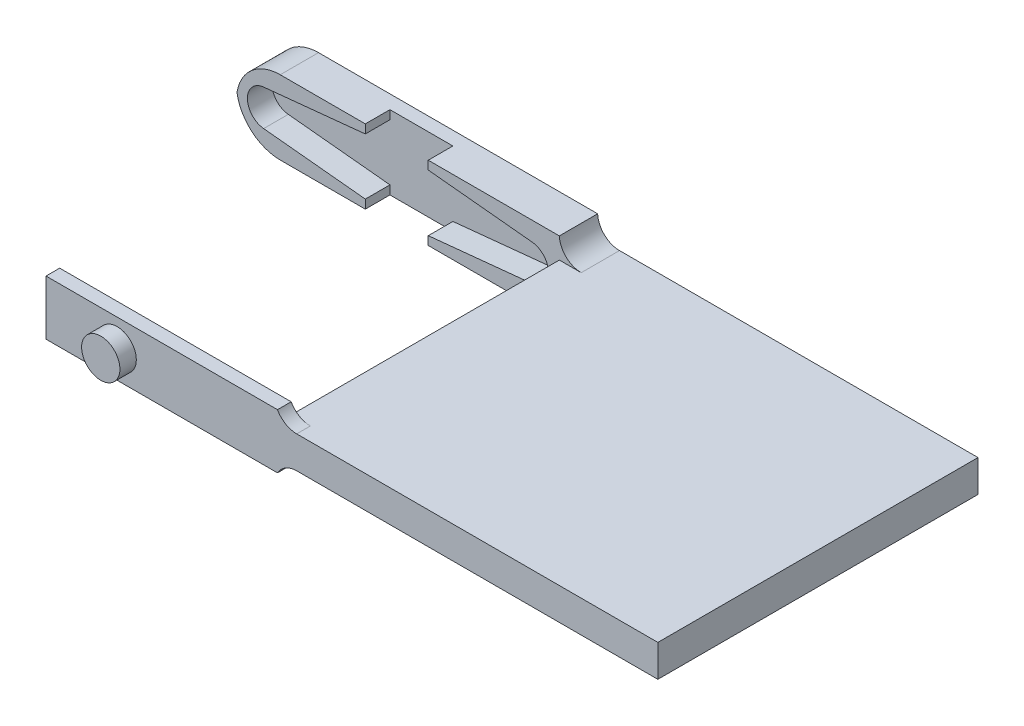
ISO-10303-21;
HEADER;
FILE_DESCRIPTION(('STEP AP214'),'2;1');
FILE_NAME('part.step','',(''),(''),'','','');
FILE_SCHEMA(('AUTOMOTIVE_DESIGN { 1 0 10303 214 1 1 1 1 }'));
ENDSEC;
DATA;
#1=APPLICATION_CONTEXT('core data for automotive mechanical design processes');
#2=APPLICATION_PROTOCOL_DEFINITION('international standard','automotive_design',2000,#1);
#3=PRODUCT_CONTEXT('',#1,'mechanical');
#4=PRODUCT('Part','Part','',(#3));
#5=PRODUCT_RELATED_PRODUCT_CATEGORY('part','',(#4));
#6=PRODUCT_DEFINITION_FORMATION('','',#4);
#7=PRODUCT_DEFINITION_CONTEXT('part definition',#1,'design');
#8=PRODUCT_DEFINITION('design','',#6,#7);
#9=PRODUCT_DEFINITION_SHAPE('','',#8);
#10=(LENGTH_UNIT() NAMED_UNIT(*) SI_UNIT(.MILLI.,.METRE.));
#11=(NAMED_UNIT(*) PLANE_ANGLE_UNIT() SI_UNIT($,.RADIAN.));
#12=(NAMED_UNIT(*) SI_UNIT($,.STERADIAN.) SOLID_ANGLE_UNIT());
#13=UNCERTAINTY_MEASURE_WITH_UNIT(LENGTH_MEASURE(1.E-05),#10,'distance_accuracy_value','');
#14=(GEOMETRIC_REPRESENTATION_CONTEXT(3) GLOBAL_UNCERTAINTY_ASSIGNED_CONTEXT((#13)) GLOBAL_UNIT_ASSIGNED_CONTEXT((#10,
#11,#12)) REPRESENTATION_CONTEXT('',''));
#15=CARTESIAN_POINT('',(0.,0.,0.));
#16=DIRECTION('',(0.,0.,1.));
#17=DIRECTION('',(1.,0.,0.));
#18=AXIS2_PLACEMENT_3D('',#15,#16,#17);
#19=CARTESIAN_POINT('',(0.,0.,29.25));
#20=DIRECTION('',(0.,0.,1.));
#21=DIRECTION('',(1.,0.,0.));
#22=AXIS2_PLACEMENT_3D('',#19,#20,#21);
#23=PLANE('',#22);
#24=DIRECTION('',(1.,0.,0.));
#25=VECTOR('',#24,1.);
#26=CARTESIAN_POINT('',(0.,4.83707186120483,29.25));
#27=LINE('',#26,#25);
#28=CARTESIAN_POINT('',(16.5034017605437,4.83707186120483,29.25));
#29=VERTEX_POINT('',#28);
#30=CARTESIAN_POINT('',(49.5,4.83707186120483,29.25));
#31=VERTEX_POINT('',#30);
#32=EDGE_CURVE('E509',#29,#31,#27,.T.);
#33=ORIENTED_EDGE('',*,*,#32,.F.);
#34=CARTESIAN_POINT('',(16.5034017605437,6.83707186120483,29.25));
#35=DIRECTION('',(0.,0.,1.));
#36=DIRECTION('',(1.,0.,0.));
#37=AXIS2_PLACEMENT_3D('',#34,#35,#36);
#38=CIRCLE('',#37,2.);
#39=CARTESIAN_POINT('',(14.75,5.87500000000001,29.25));
#40=VERTEX_POINT('',#39);
#41=EDGE_CURVE('E445',#29,#40,#38,.F.);
#42=ORIENTED_EDGE('',*,*,#41,.T.);
#43=DIRECTION('',(1.,0.,0.));
#44=VECTOR('',#43,1.);
#45=CARTESIAN_POINT('',(0.,5.87500000000001,29.25));
#46=LINE('',#45,#44);
#47=CARTESIAN_POINT('',(-6.4,5.875,29.25));
#48=VERTEX_POINT('',#47);
#49=EDGE_CURVE('E470',#48,#40,#46,.T.);
#50=ORIENTED_EDGE('',*,*,#49,.F.);
#51=DIRECTION('',(0.,-1.,0.));
#52=VECTOR('',#51,1.);
#53=CARTESIAN_POINT('',(-6.4,0.,29.25));
#54=LINE('',#53,#52);
#55=CARTESIAN_POINT('',(-6.4,0.875000000000003,29.25));
#56=VERTEX_POINT('',#55);
#57=EDGE_CURVE('E473',#48,#56,#54,.T.);
#58=ORIENTED_EDGE('',*,*,#57,.T.);
#59=DIRECTION('',(1.,0.,0.));
#60=VECTOR('',#59,1.);
#61=CARTESIAN_POINT('',(0.,0.875000000000003,29.25));
#62=LINE('',#61,#60);
#63=CARTESIAN_POINT('',(14.75,0.875000000000003,29.25));
#64=VERTEX_POINT('',#63);
#65=EDGE_CURVE('E488',#56,#64,#62,.T.);
#66=ORIENTED_EDGE('',*,*,#65,.T.);
#67=CARTESIAN_POINT('',(16.5034017605437,-0.0870718612048299,29.25));
#68=DIRECTION('',(0.,0.,1.));
#69=DIRECTION('',(1.,0.,0.));
#70=AXIS2_PLACEMENT_3D('',#67,#68,#69);
#71=CIRCLE('',#70,2.);
#72=CARTESIAN_POINT('',(16.5034017605437,1.91292813879517,29.25));
#73=VERTEX_POINT('',#72);
#74=EDGE_CURVE('E449',#64,#73,#71,.F.);
#75=ORIENTED_EDGE('',*,*,#74,.T.);
#76=DIRECTION('',(1.,0.,0.));
#77=VECTOR('',#76,1.);
#78=CARTESIAN_POINT('',(0.,1.91292813879517,29.25));
#79=LINE('',#78,#77);
#80=CARTESIAN_POINT('',(49.5,1.91292813879517,29.25));
#81=VERTEX_POINT('',#80);
#82=EDGE_CURVE('E511',#73,#81,#79,.T.);
#83=ORIENTED_EDGE('',*,*,#82,.T.);
#84=DIRECTION('',(0.,-1.,0.));
#85=VECTOR('',#84,1.);
#86=CARTESIAN_POINT('',(49.5,0.,29.25));
#87=LINE('',#86,#85);
#88=EDGE_CURVE('E513',#31,#81,#87,.T.);
#89=ORIENTED_EDGE('',*,*,#88,.F.);
#90=EDGE_LOOP('',(#33,#42,#50,#58,#66,#75,#83,#89));
#91=FACE_BOUND('',#90,.T.);
#92=CARTESIAN_POINT('',(0.102107464173086,3.37500000000001,29.25));
#93=DIRECTION('',(0.,0.,1.));
#94=DIRECTION('',(1.,0.,0.));
#95=AXIS2_PLACEMENT_3D('',#92,#93,#94);
#96=CIRCLE('',#95,1.7500000000003);
#97=CARTESIAN_POINT('',(1.85210746417339,3.37500000000001,29.25));
#98=VERTEX_POINT('',#97);
#99=EDGE_CURVE('E592',#98,#98,#96,.T.);
#100=ORIENTED_EDGE('',*,*,#99,.F.);
#101=EDGE_LOOP('',(#100));
#102=FACE_BOUND('',#101,.T.);
#103=ADVANCED_FACE('F139',(#91,#102),#23,.T.);
#104=CARTESIAN_POINT('',(0.,0.,3.5));
#105=DIRECTION('',(0.,0.,1.));
#106=DIRECTION('',(1.,0.,0.));
#107=AXIS2_PLACEMENT_3D('',#104,#105,#106);
#108=PLANE('',#107);
#109=DIRECTION('',(0.,-1.,0.));
#110=VECTOR('',#109,1.);
#111=CARTESIAN_POINT('',(-2.97710746417325,0.,3.5));
#112=LINE('',#111,#110);
#113=CARTESIAN_POINT('',(-2.97710746417325,0.79935421821004,3.5));
#114=VERTEX_POINT('',#113);
#115=CARTESIAN_POINT('',(-2.97710746417325,0.,3.5));
#116=VERTEX_POINT('',#115);
#117=EDGE_CURVE('E330',#114,#116,#112,.T.);
#118=ORIENTED_EDGE('',*,*,#117,.F.);
#119=DIRECTION('',(0.994982658758142,-0.10004753255617,0.));
#120=VECTOR('',#119,1.);
#121=CARTESIAN_POINT('',(0.0497727799724651,0.494995245614711,3.5));
#122=LINE('',#121,#120);
#123=CARTESIAN_POINT('',(-12.2650784287177,1.73327861304907,3.5));
#124=VERTEX_POINT('',#123);
#125=EDGE_CURVE('E370',#124,#114,#122,.T.);
#126=ORIENTED_EDGE('',*,*,#125,.F.);
#127=CARTESIAN_POINT('',(-12.1,3.375,3.5));
#128=DIRECTION('',(0.,0.,1.));
#129=DIRECTION('',(1.,0.,0.));
#130=AXIS2_PLACEMENT_3D('',#127,#128,#129);
#131=CIRCLE('',#130,1.65);
#132=CARTESIAN_POINT('',(-12.2650784287177,5.01672138695093,3.5));
#133=VERTEX_POINT('',#132);
#134=EDGE_CURVE('E372',#133,#124,#131,.T.);
#135=ORIENTED_EDGE('',*,*,#134,.F.);
#136=DIRECTION('',(0.994982658758143,0.100047532556171,0.));
#137=VECTOR('',#136,1.);
#138=CARTESIAN_POINT('',(-0.622159749655816,6.18744057018389,3.5));
#139=LINE('',#138,#137);
#140=CARTESIAN_POINT('',(-2.97710746417325,5.95064578178996,3.5));
#141=VERTEX_POINT('',#140);
#142=EDGE_CURVE('E375',#133,#141,#139,.T.);
#143=ORIENTED_EDGE('',*,*,#142,.T.);
#144=DIRECTION('',(0.,-1.,0.));
#145=VECTOR('',#144,1.);
#146=CARTESIAN_POINT('',(-2.97710746417325,6.7500000000001,3.5));
#147=LINE('',#146,#145);
#148=CARTESIAN_POINT('',(-2.97710746417325,6.7500000000001,3.5));
#149=VERTEX_POINT('',#148);
#150=EDGE_CURVE('E605',#149,#141,#147,.T.);
#151=ORIENTED_EDGE('',*,*,#150,.F.);
#152=DIRECTION('',(1.,0.,0.));
#153=VECTOR('',#152,1.);
#154=CARTESIAN_POINT('',(0.,6.75,3.5));
#155=LINE('',#154,#153);
#156=CARTESIAN_POINT('',(-10.75,6.75,3.5));
#157=VERTEX_POINT('',#156);
#158=EDGE_CURVE('E361',#157,#149,#155,.T.);
#159=ORIENTED_EDGE('',*,*,#158,.F.);
#160=CARTESIAN_POINT('',(-10.75,2.75,3.5));
#161=DIRECTION('',(0.,0.,1.));
#162=DIRECTION('',(1.,0.,0.));
#163=AXIS2_PLACEMENT_3D('',#160,#161,#162);
#164=CIRCLE('',#163,4.);
#165=CARTESIAN_POINT('',(-14.7008701573198,3.37499999999999,3.5));
#166=VERTEX_POINT('',#165);
#167=EDGE_CURVE('E148',#157,#166,#164,.T.);
#168=ORIENTED_EDGE('',*,*,#167,.T.);
#169=CARTESIAN_POINT('',(-10.75,4.,3.5));
#170=DIRECTION('',(0.,0.,1.));
#171=DIRECTION('',(1.,0.,0.));
#172=AXIS2_PLACEMENT_3D('',#169,#170,#171);
#173=CIRCLE('',#172,4.);
#174=CARTESIAN_POINT('',(-10.75,0.,3.5));
#175=VERTEX_POINT('',#174);
#176=EDGE_CURVE('E354',#166,#175,#173,.T.);
#177=ORIENTED_EDGE('',*,*,#176,.T.);
#178=DIRECTION('',(1.,0.,0.));
#179=VECTOR('',#178,1.);
#180=CARTESIAN_POINT('',(0.,0.,3.5));
#181=LINE('',#180,#179);
#182=EDGE_CURVE('E347',#175,#116,#181,.T.);
#183=ORIENTED_EDGE('',*,*,#182,.T.);
#184=EDGE_LOOP('',(#118,#126,#135,#143,#151,#159,#168,#177,#183));
#185=FACE_BOUND('',#184,.T.);
#186=ADVANCED_FACE('F352',(#185),#108,.T.);
#187=CARTESIAN_POINT('',(14.75,0.,29.25));
#188=DIRECTION('',(1.,0.,0.));
#189=DIRECTION('',(0.,1.,0.));
#190=AXIS2_PLACEMENT_3D('',#187,#188,#189);
#191=PLANE('',#190);
#192=DIRECTION('',(0.,-1.,0.));
#193=VECTOR('',#192,1.);
#194=CARTESIAN_POINT('',(14.75,0.,28.));
#195=LINE('',#194,#193);
#196=CARTESIAN_POINT('',(14.75,4.83707186120483,28.));
#197=VERTEX_POINT('',#196);
#198=CARTESIAN_POINT('',(14.75,1.91292813879517,28.));
#199=VERTEX_POINT('',#198);
#200=EDGE_CURVE('E484',#197,#199,#195,.T.);
#201=ORIENTED_EDGE('',*,*,#200,.F.);
#202=DIRECTION('',(0.,0.,-1.));
#203=VECTOR('',#202,1.);
#204=CARTESIAN_POINT('',(14.75,4.83707186120483,29.25));
#205=LINE('',#204,#203);
#206=CARTESIAN_POINT('',(14.75,4.83707186120483,3.5));
#207=VERTEX_POINT('',#206);
#208=EDGE_CURVE('E527',#197,#207,#205,.T.);
#209=ORIENTED_EDGE('',*,*,#208,.T.);
#210=DIRECTION('',(0.,-1.,0.));
#211=VECTOR('',#210,1.);
#212=CARTESIAN_POINT('',(14.75,0.,3.5));
#213=LINE('',#212,#211);
#214=CARTESIAN_POINT('',(14.75,1.91292813879517,3.5));
#215=VERTEX_POINT('',#214);
#216=EDGE_CURVE('E384',#207,#215,#213,.T.);
#217=ORIENTED_EDGE('',*,*,#216,.T.);
#218=DIRECTION('',(0.,0.,-1.));
#219=VECTOR('',#218,1.);
#220=CARTESIAN_POINT('',(14.75,1.91292813879517,29.25));
#221=LINE('',#220,#219);
#222=EDGE_CURVE('E524',#199,#215,#221,.T.);
#223=ORIENTED_EDGE('',*,*,#222,.F.);
#224=EDGE_LOOP('',(#201,#209,#217,#223));
#225=FACE_BOUND('',#224,.T.);
#226=ADVANCED_FACE('F647',(#225),#191,.F.);
#227=CARTESIAN_POINT('',(0.622159749655816,6.18744057018389,3.5));
#228=DIRECTION('',(-0.100047532556171,-0.994982658758142,0.));
#229=DIRECTION('',(0.994982658758142,-0.100047532556171,0.));
#230=AXIS2_PLACEMENT_3D('',#227,#228,#229);
#231=PLANE('',#230);
#232=DIRECTION('',(0.,0.,1.));
#233=VECTOR('',#232,1.);
#234=CARTESIAN_POINT('',(2.77289253582673,5.97118000870574,3.5));
#235=LINE('',#234,#233);
#236=CARTESIAN_POINT('',(2.77289253582673,5.97118000870574,1.24999999999995));
#237=VERTEX_POINT('',#236);
#238=CARTESIAN_POINT('',(2.77289253582673,5.97118000870574,3.5));
#239=VERTEX_POINT('',#238);
#240=EDGE_CURVE('E163',#237,#239,#235,.T.);
#241=ORIENTED_EDGE('',*,*,#240,.F.);
#242=DIRECTION('',(-0.994982658758143,0.100047532556171,0.));
#243=VECTOR('',#242,1.);
#244=CARTESIAN_POINT('',(0.622159749655816,6.18744057018389,1.25));
#245=LINE('',#244,#243);
#246=CARTESIAN_POINT('',(12.2650784287177,5.01672138695093,1.25));
#247=VERTEX_POINT('',#246);
#248=EDGE_CURVE('E533',#247,#237,#245,.T.);
#249=ORIENTED_EDGE('',*,*,#248,.F.);
#250=DIRECTION('',(0.,0.,-1.));
#251=VECTOR('',#250,1.);
#252=CARTESIAN_POINT('',(12.2650784287177,5.01672138695093,3.5));
#253=LINE('',#252,#251);
#254=CARTESIAN_POINT('',(12.2650784287177,5.01672138695093,3.5));
#255=VERTEX_POINT('',#254);
#256=EDGE_CURVE('E395',#255,#247,#253,.T.);
#257=ORIENTED_EDGE('',*,*,#256,.F.);
#258=DIRECTION('',(-0.994982658758143,0.100047532556171,0.));
#259=VECTOR('',#258,1.);
#260=CARTESIAN_POINT('',(0.622159749655816,6.18744057018389,3.5));
#261=LINE('',#260,#259);
#262=EDGE_CURVE('E355',#255,#239,#261,.T.);
#263=ORIENTED_EDGE('',*,*,#262,.T.);
#264=EDGE_LOOP('',(#241,#249,#257,#263));
#265=FACE_BOUND('',#264,.T.);
#266=ADVANCED_FACE('F662',(#265),#231,.T.);
#267=CARTESIAN_POINT('',(12.1,3.375,3.5));
#268=DIRECTION('',(0.,0.,-1.));
#269=DIRECTION('',(-1.,0.,0.));
#270=AXIS2_PLACEMENT_3D('',#267,#268,#269);
#271=CYLINDRICAL_SURFACE('',#270,1.64999999999999);
#272=ORIENTED_EDGE('',*,*,#256,.T.);
#273=CARTESIAN_POINT('',(12.1,3.375,1.25));
#274=DIRECTION('',(0.,0.,1.));
#275=DIRECTION('',(1.,0.,0.));
#276=AXIS2_PLACEMENT_3D('',#273,#274,#275);
#277=CIRCLE('',#276,1.64999999999999);
#278=CARTESIAN_POINT('',(12.2650784287177,1.73327861304907,1.25));
#279=VERTEX_POINT('',#278);
#280=EDGE_CURVE('E530',#247,#279,#277,.F.);
#281=ORIENTED_EDGE('',*,*,#280,.T.);
#282=DIRECTION('',(0.,0.,-1.));
#283=VECTOR('',#282,1.);
#284=CARTESIAN_POINT('',(12.2650784287177,1.73327861304907,3.5));
#285=LINE('',#284,#283);
#286=CARTESIAN_POINT('',(12.2650784287177,1.73327861304907,3.5));
#287=VERTEX_POINT('',#286);
#288=EDGE_CURVE('E392',#287,#279,#285,.T.);
#289=ORIENTED_EDGE('',*,*,#288,.F.);
#290=CARTESIAN_POINT('',(12.1,3.375,3.5));
#291=DIRECTION('',(0.,0.,1.));
#292=DIRECTION('',(1.,0.,0.));
#293=AXIS2_PLACEMENT_3D('',#290,#291,#292);
#294=CIRCLE('',#293,1.64999999999999);
#295=EDGE_CURVE('E359',#255,#287,#294,.F.);
#296=ORIENTED_EDGE('',*,*,#295,.F.);
#297=EDGE_LOOP('',(#272,#281,#289,#296));
#298=FACE_BOUND('',#297,.T.);
#299=ADVANCED_FACE('F638',(#298),#271,.F.);
#300=CARTESIAN_POINT('',(-0.0497727799724653,0.49499524561471,3.5));
#301=DIRECTION('',(0.100047532556171,-0.994982658758142,0.));
#302=DIRECTION('',(0.994982658758143,0.100047532556171,0.));
#303=AXIS2_PLACEMENT_3D('',#300,#301,#302);
#304=PLANE('',#303);
#305=DIRECTION('',(-0.994982658758142,-0.100047532556171,0.));
#306=VECTOR('',#305,1.);
#307=CARTESIAN_POINT('',(-0.0497727799724653,0.49499524561471,1.25));
#308=LINE('',#307,#306);
#309=CARTESIAN_POINT('',(2.77289253582673,0.778819991294262,1.24999999999995));
#310=VERTEX_POINT('',#309);
#311=EDGE_CURVE('E382',#279,#310,#308,.T.);
#312=ORIENTED_EDGE('',*,*,#311,.T.);
#313=DIRECTION('',(0.,0.,1.));
#314=VECTOR('',#313,1.);
#315=CARTESIAN_POINT('',(2.77289253582673,0.778819991294262,3.5));
#316=LINE('',#315,#314);
#317=CARTESIAN_POINT('',(2.77289253582673,0.778819991294262,3.5));
#318=VERTEX_POINT('',#317);
#319=EDGE_CURVE('E599',#310,#318,#316,.T.);
#320=ORIENTED_EDGE('',*,*,#319,.T.);
#321=DIRECTION('',(-0.994982658758142,-0.100047532556171,0.));
#322=VECTOR('',#321,1.);
#323=CARTESIAN_POINT('',(-0.0497727799724653,0.49499524561471,3.5));
#324=LINE('',#323,#322);
#325=EDGE_CURVE('E367',#287,#318,#324,.T.);
#326=ORIENTED_EDGE('',*,*,#325,.F.);
#327=ORIENTED_EDGE('',*,*,#288,.T.);
#328=EDGE_LOOP('',(#312,#320,#326,#327));
#329=FACE_BOUND('',#328,.T.);
#330=ADVANCED_FACE('F631',(#329),#304,.F.);
#331=CARTESIAN_POINT('',(0.0497727799724651,0.494995245614711,3.5));
#332=DIRECTION('',(0.10004753255617,0.994982658758143,0.));
#333=DIRECTION('',(-0.994982658758143,0.10004753255617,0.));
#334=AXIS2_PLACEMENT_3D('',#331,#332,#333);
#335=PLANE('',#334);
#336=DIRECTION('',(0.,0.,1.));
#337=VECTOR('',#336,1.);
#338=CARTESIAN_POINT('',(-2.97710746417325,0.79935421821004,3.5));
#339=LINE('',#338,#337);
#340=CARTESIAN_POINT('',(-2.97710746417325,0.79935421821004,1.24999999999995));
#341=VERTEX_POINT('',#340);
#342=EDGE_CURVE('E336',#341,#114,#339,.T.);
#343=ORIENTED_EDGE('',*,*,#342,.F.);
#344=DIRECTION('',(0.994982658758142,-0.10004753255617,0.));
#345=VECTOR('',#344,1.);
#346=CARTESIAN_POINT('',(0.0497727799724651,0.494995245614711,1.25));
#347=LINE('',#346,#345);
#348=CARTESIAN_POINT('',(-12.2650784287177,1.73327861304907,1.25));
#349=VERTEX_POINT('',#348);
#350=EDGE_CURVE('E540',#349,#341,#347,.T.);
#351=ORIENTED_EDGE('',*,*,#350,.F.);
#352=DIRECTION('',(0.,0.,-1.));
#353=VECTOR('',#352,1.);
#354=CARTESIAN_POINT('',(-12.2650784287177,1.73327861304907,3.5));
#355=LINE('',#354,#353);
#356=EDGE_CURVE('E388',#124,#349,#355,.T.);
#357=ORIENTED_EDGE('',*,*,#356,.F.);
#358=ORIENTED_EDGE('',*,*,#125,.T.);
#359=EDGE_LOOP('',(#343,#351,#357,#358));
#360=FACE_BOUND('',#359,.T.);
#361=ADVANCED_FACE('F629',(#360),#335,.T.);
#362=CARTESIAN_POINT('',(-12.1,3.375,3.5));
#363=DIRECTION('',(0.,0.,-1.));
#364=DIRECTION('',(-1.,0.,0.));
#365=AXIS2_PLACEMENT_3D('',#362,#363,#364);
#366=CYLINDRICAL_SURFACE('',#365,1.65);
#367=CARTESIAN_POINT('',(-12.1,3.375,1.25));
#368=DIRECTION('',(0.,0.,1.));
#369=DIRECTION('',(1.,0.,0.));
#370=AXIS2_PLACEMENT_3D('',#367,#368,#369);
#371=CIRCLE('',#370,1.65);
#372=CARTESIAN_POINT('',(-12.2650784287177,5.01672138695093,1.25));
#373=VERTEX_POINT('',#372);
#374=EDGE_CURVE('E538',#373,#349,#371,.T.);
#375=ORIENTED_EDGE('',*,*,#374,.F.);
#376=DIRECTION('',(0.,0.,-1.));
#377=VECTOR('',#376,1.);
#378=CARTESIAN_POINT('',(-12.2650784287177,5.01672138695093,3.5));
#379=LINE('',#378,#377);
#380=EDGE_CURVE('E385',#133,#373,#379,.T.);
#381=ORIENTED_EDGE('',*,*,#380,.F.);
#382=ORIENTED_EDGE('',*,*,#134,.T.);
#383=ORIENTED_EDGE('',*,*,#356,.T.);
#384=EDGE_LOOP('',(#375,#381,#382,#383));
#385=FACE_BOUND('',#384,.T.);
#386=ADVANCED_FACE('F624',(#385),#366,.F.);
#387=CARTESIAN_POINT('',(0.,6.75,3.5));
#388=DIRECTION('',(0.,1.,0.));
#389=DIRECTION('',(0.,0.,1.));
#390=AXIS2_PLACEMENT_3D('',#387,#388,#389);
#391=PLANE('',#390);
#392=DIRECTION('',(0.,0.,1.));
#393=VECTOR('',#392,1.);
#394=CARTESIAN_POINT('',(-2.97710746417325,6.7500000000001,-4.60902082262902));
#395=LINE('',#394,#393);
#396=CARTESIAN_POINT('',(-2.97710746417325,6.7500000000001,1.24999999999995));
#397=VERTEX_POINT('',#396);
#398=EDGE_CURVE('E480',#397,#149,#395,.T.);
#399=ORIENTED_EDGE('',*,*,#398,.F.);
#400=DIRECTION('',(-1.,0.,0.));
#401=VECTOR('',#400,1.);
#402=CARTESIAN_POINT('',(-2.97710746417325,6.7500000000001,1.24999999999995));
#403=LINE('',#402,#401);
#404=CARTESIAN_POINT('',(2.77289253582673,6.7500000000001,1.24999999999995));
#405=VERTEX_POINT('',#404);
#406=EDGE_CURVE('E613',#405,#397,#403,.T.);
#407=ORIENTED_EDGE('',*,*,#406,.F.);
#408=DIRECTION('',(0.,0.,1.));
#409=VECTOR('',#408,1.);
#410=CARTESIAN_POINT('',(2.77289253582673,6.7500000000001,-4.60902082262902));
#411=LINE('',#410,#409);
#412=CARTESIAN_POINT('',(2.77289253582673,6.7500000000001,3.5));
#413=VERTEX_POINT('',#412);
#414=EDGE_CURVE('E616',#405,#413,#411,.T.);
#415=ORIENTED_EDGE('',*,*,#414,.T.);
#416=CARTESIAN_POINT('',(14.75,6.75,3.5));
#417=VERTEX_POINT('',#416);
#418=EDGE_CURVE('E545',#413,#417,#155,.T.);
#419=ORIENTED_EDGE('',*,*,#418,.T.);
#420=DIRECTION('',(0.,0.,-1.));
#421=VECTOR('',#420,1.);
#422=CARTESIAN_POINT('',(14.75,6.75,3.5));
#423=LINE('',#422,#421);
#424=CARTESIAN_POINT('',(14.75,6.75,0.));
#425=VERTEX_POINT('',#424);
#426=EDGE_CURVE('E389',#417,#425,#423,.T.);
#427=ORIENTED_EDGE('',*,*,#426,.T.);
#428=DIRECTION('',(1.,0.,0.));
#429=VECTOR('',#428,1.);
#430=CARTESIAN_POINT('',(0.,6.75,0.));
#431=LINE('',#430,#429);
#432=CARTESIAN_POINT('',(-10.75,6.75,0.));
#433=VERTEX_POINT('',#432);
#434=EDGE_CURVE('E379',#433,#425,#431,.T.);
#435=ORIENTED_EDGE('',*,*,#434,.F.);
#436=DIRECTION('',(0.,0.,-1.));
#437=VECTOR('',#436,1.);
#438=CARTESIAN_POINT('',(-10.75,6.75,3.5));
#439=LINE('',#438,#437);
#440=EDGE_CURVE('E455',#433,#157,#439,.F.);
#441=ORIENTED_EDGE('',*,*,#440,.T.);
#442=ORIENTED_EDGE('',*,*,#158,.T.);
#443=EDGE_LOOP('',(#399,#407,#415,#419,#427,#435,#441,#442));
#444=FACE_BOUND('',#443,.T.);
#445=ADVANCED_FACE('F553',(#444),#391,.T.);
#446=CARTESIAN_POINT('',(0.,0.,3.5));
#447=DIRECTION('',(0.,1.,0.));
#448=DIRECTION('',(0.,0.,1.));
#449=AXIS2_PLACEMENT_3D('',#446,#447,#448);
#450=PLANE('',#449);
#451=DIRECTION('',(1.,0.,0.));
#452=VECTOR('',#451,1.);
#453=CARTESIAN_POINT('',(-2.97710746417325,0.,1.24999999999995));
#454=LINE('',#453,#452);
#455=CARTESIAN_POINT('',(-2.97710746417325,0.,1.24999999999995));
#456=VERTEX_POINT('',#455);
#457=CARTESIAN_POINT('',(2.77289253582673,0.,1.24999999999995));
#458=VERTEX_POINT('',#457);
#459=EDGE_CURVE('E350',#456,#458,#454,.T.);
#460=ORIENTED_EDGE('',*,*,#459,.F.);
#461=DIRECTION('',(0.,0.,1.));
#462=VECTOR('',#461,1.);
#463=CARTESIAN_POINT('',(-2.97710746417325,0.,-4.60902082262902));
#464=LINE('',#463,#462);
#465=EDGE_CURVE('E333',#456,#116,#464,.T.);
#466=ORIENTED_EDGE('',*,*,#465,.T.);
#467=ORIENTED_EDGE('',*,*,#182,.F.);
#468=DIRECTION('',(0.,0.,-1.));
#469=VECTOR('',#468,1.);
#470=CARTESIAN_POINT('',(-10.75,0.,0.));
#471=LINE('',#470,#469);
#472=CARTESIAN_POINT('',(-10.75,0.,0.));
#473=VERTEX_POINT('',#472);
#474=EDGE_CURVE('E12',#175,#473,#471,.T.);
#475=ORIENTED_EDGE('',*,*,#474,.T.);
#476=DIRECTION('',(1.,0.,0.));
#477=VECTOR('',#476,1.);
#478=CARTESIAN_POINT('',(0.,0.,0.));
#479=LINE('',#478,#477);
#480=CARTESIAN_POINT('',(14.75,0.,0.));
#481=VERTEX_POINT('',#480);
#482=EDGE_CURVE('E381',#473,#481,#479,.T.);
#483=ORIENTED_EDGE('',*,*,#482,.T.);
#484=DIRECTION('',(0.,0.,-1.));
#485=VECTOR('',#484,1.);
#486=CARTESIAN_POINT('',(14.75,0.,3.5));
#487=LINE('',#486,#485);
#488=CARTESIAN_POINT('',(14.75,0.,3.5));
#489=VERTEX_POINT('',#488);
#490=EDGE_CURVE('E378',#489,#481,#487,.T.);
#491=ORIENTED_EDGE('',*,*,#490,.F.);
#492=CARTESIAN_POINT('',(2.77289253582673,0.,3.5));
#493=VERTEX_POINT('',#492);
#494=EDGE_CURVE('E356',#493,#489,#181,.T.);
#495=ORIENTED_EDGE('',*,*,#494,.F.);
#496=DIRECTION('',(0.,0.,1.));
#497=VECTOR('',#496,1.);
#498=CARTESIAN_POINT('',(2.77289253582673,0.,-4.60902082262902));
#499=LINE('',#498,#497);
#500=EDGE_CURVE('E155',#458,#493,#499,.T.);
#501=ORIENTED_EDGE('',*,*,#500,.F.);
#502=EDGE_LOOP('',(#460,#466,#467,#475,#483,#491,#495,#501));
#503=FACE_BOUND('',#502,.T.);
#504=ADVANCED_FACE('F346',(#503),#450,.F.);
#505=CARTESIAN_POINT('',(-0.622159749655816,6.18744057018389,3.5));
#506=DIRECTION('',(-0.100047532556171,0.994982658758142,0.));
#507=DIRECTION('',(-0.994982658758142,-0.100047532556171,0.));
#508=AXIS2_PLACEMENT_3D('',#505,#506,#507);
#509=PLANE('',#508);
#510=DIRECTION('',(0.994982658758143,0.100047532556171,0.));
#511=VECTOR('',#510,1.);
#512=CARTESIAN_POINT('',(-0.622159749655816,6.18744057018389,1.25));
#513=LINE('',#512,#511);
#514=CARTESIAN_POINT('',(-2.97710746417325,5.95064578178996,1.24999999999995));
#515=VERTEX_POINT('',#514);
#516=EDGE_CURVE('E536',#373,#515,#513,.T.);
#517=ORIENTED_EDGE('',*,*,#516,.T.);
#518=DIRECTION('',(0.,0.,1.));
#519=VECTOR('',#518,1.);
#520=CARTESIAN_POINT('',(-2.97710746417325,5.95064578178996,3.5));
#521=LINE('',#520,#519);
#522=EDGE_CURVE('E471',#515,#141,#521,.T.);
#523=ORIENTED_EDGE('',*,*,#522,.T.);
#524=ORIENTED_EDGE('',*,*,#142,.F.);
#525=ORIENTED_EDGE('',*,*,#380,.T.);
#526=EDGE_LOOP('',(#517,#523,#524,#525));
#527=FACE_BOUND('',#526,.T.);
#528=ADVANCED_FACE('F621',(#527),#509,.F.);
#529=DIRECTION('',(0.,1.,0.));
#530=VECTOR('',#529,1.);
#531=CARTESIAN_POINT('',(2.77289253582673,0.,3.5));
#532=LINE('',#531,#530);
#533=EDGE_CURVE('E342',#493,#318,#532,.T.);
#534=ORIENTED_EDGE('',*,*,#533,.F.);
#535=ORIENTED_EDGE('',*,*,#494,.T.);
#536=CARTESIAN_POINT('',(16.7481037237807,-0.0870718612048299,3.5));
#537=DIRECTION('',(0.,0.,1.));
#538=DIRECTION('',(1.,0.,0.));
#539=AXIS2_PLACEMENT_3D('',#536,#537,#538);
#540=CIRCLE('',#539,2.);
#541=CARTESIAN_POINT('',(16.7481037237807,1.91292813879517,3.5));
#542=VERTEX_POINT('',#541);
#543=EDGE_CURVE('E441',#489,#542,#540,.F.);
#544=ORIENTED_EDGE('',*,*,#543,.T.);
#545=DIRECTION('',(1.,0.,0.));
#546=VECTOR('',#545,1.);
#547=CARTESIAN_POINT('',(0.,1.91292813879517,3.5));
#548=LINE('',#547,#546);
#549=EDGE_CURVE('E427',#215,#542,#548,.T.);
#550=ORIENTED_EDGE('',*,*,#549,.F.);
#551=ORIENTED_EDGE('',*,*,#216,.F.);
#552=DIRECTION('',(-1.,0.,0.));
#553=VECTOR('',#552,1.);
#554=CARTESIAN_POINT('',(0.,4.83707186120483,3.5));
#555=LINE('',#554,#553);
#556=CARTESIAN_POINT('',(16.7481037237807,4.83707186120483,3.5));
#557=VERTEX_POINT('',#556);
#558=EDGE_CURVE('E415',#557,#207,#555,.T.);
#559=ORIENTED_EDGE('',*,*,#558,.F.);
#560=CARTESIAN_POINT('',(16.7481037237807,6.83707186120483,3.5));
#561=DIRECTION('',(0.,0.,1.));
#562=DIRECTION('',(1.,0.,0.));
#563=AXIS2_PLACEMENT_3D('',#560,#561,#562);
#564=CIRCLE('',#563,2.);
#565=EDGE_CURVE('E435',#557,#417,#564,.F.);
#566=ORIENTED_EDGE('',*,*,#565,.T.);
#567=ORIENTED_EDGE('',*,*,#418,.F.);
#568=DIRECTION('',(0.,1.,0.));
#569=VECTOR('',#568,1.);
#570=CARTESIAN_POINT('',(2.77289253582673,6.7500000000001,3.5));
#571=LINE('',#570,#569);
#572=EDGE_CURVE('E606',#239,#413,#571,.T.);
#573=ORIENTED_EDGE('',*,*,#572,.F.);
#574=ORIENTED_EDGE('',*,*,#262,.F.);
#575=ORIENTED_EDGE('',*,*,#295,.T.);
#576=ORIENTED_EDGE('',*,*,#325,.T.);
#577=EDGE_LOOP('',(#534,#535,#544,#550,#551,#559,#566,#567,#573,#574,#575,#576));
#578=FACE_BOUND('',#577,.T.);
#579=ADVANCED_FACE('F587',(#578),#108,.T.);
#580=CARTESIAN_POINT('',(0.,0.,0.));
#581=DIRECTION('',(0.,0.,1.));
#582=DIRECTION('',(1.,0.,0.));
#583=AXIS2_PLACEMENT_3D('',#580,#581,#582);
#584=PLANE('',#583);
#585=CARTESIAN_POINT('',(-10.75,4.,0.));
#586=DIRECTION('',(0.,0.,1.));
#587=DIRECTION('',(1.,0.,0.));
#588=AXIS2_PLACEMENT_3D('',#585,#586,#587);
#589=CIRCLE('',#588,4.);
#590=CARTESIAN_POINT('',(-14.7008701573198,3.37499999999999,0.));
#591=VERTEX_POINT('',#590);
#592=EDGE_CURVE('E451',#473,#591,#589,.F.);
#593=ORIENTED_EDGE('',*,*,#592,.T.);
#594=CARTESIAN_POINT('',(-10.75,2.75,0.));
#595=DIRECTION('',(0.,0.,1.));
#596=DIRECTION('',(1.,0.,0.));
#597=AXIS2_PLACEMENT_3D('',#594,#595,#596);
#598=CIRCLE('',#597,4.);
#599=EDGE_CURVE('E453',#591,#433,#598,.F.);
#600=ORIENTED_EDGE('',*,*,#599,.T.);
#601=ORIENTED_EDGE('',*,*,#434,.T.);
#602=CARTESIAN_POINT('',(16.7481037237807,6.83707186120483,0.));
#603=DIRECTION('',(0.,0.,1.));
#604=DIRECTION('',(1.,0.,0.));
#605=AXIS2_PLACEMENT_3D('',#602,#603,#604);
#606=CIRCLE('',#605,2.);
#607=CARTESIAN_POINT('',(16.7481037237807,4.83707186120483,0.));
#608=VERTEX_POINT('',#607);
#609=EDGE_CURVE('E433',#425,#608,#606,.T.);
#610=ORIENTED_EDGE('',*,*,#609,.T.);
#611=DIRECTION('',(1.,0.,0.));
#612=VECTOR('',#611,1.);
#613=CARTESIAN_POINT('',(0.,4.83707186120483,0.));
#614=LINE('',#613,#612);
#615=CARTESIAN_POINT('',(49.5,4.83707186120483,0.));
#616=VERTEX_POINT('',#615);
#617=EDGE_CURVE('E407',#608,#616,#614,.T.);
#618=ORIENTED_EDGE('',*,*,#617,.T.);
#619=DIRECTION('',(0.,-1.,0.));
#620=VECTOR('',#619,1.);
#621=CARTESIAN_POINT('',(49.5,0.,0.));
#622=LINE('',#621,#620);
#623=CARTESIAN_POINT('',(49.5,1.91292813879517,0.));
#624=VERTEX_POINT('',#623);
#625=EDGE_CURVE('E422',#616,#624,#622,.T.);
#626=ORIENTED_EDGE('',*,*,#625,.T.);
#627=DIRECTION('',(1.,0.,0.));
#628=VECTOR('',#627,1.);
#629=CARTESIAN_POINT('',(0.,1.91292813879517,0.));
#630=LINE('',#629,#628);
#631=CARTESIAN_POINT('',(16.7481037237807,1.91292813879517,0.));
#632=VERTEX_POINT('',#631);
#633=EDGE_CURVE('E409',#632,#624,#630,.T.);
#634=ORIENTED_EDGE('',*,*,#633,.F.);
#635=CARTESIAN_POINT('',(16.7481037237807,-0.0870718612048299,0.));
#636=DIRECTION('',(0.,0.,1.));
#637=DIRECTION('',(1.,0.,0.));
#638=AXIS2_PLACEMENT_3D('',#635,#636,#637);
#639=CIRCLE('',#638,2.);
#640=EDGE_CURVE('E438',#632,#481,#639,.T.);
#641=ORIENTED_EDGE('',*,*,#640,.T.);
#642=ORIENTED_EDGE('',*,*,#482,.F.);
#643=EDGE_LOOP('',(#593,#600,#601,#610,#618,#626,#634,#641,#642));
#644=FACE_BOUND('',#643,.T.);
#645=ADVANCED_FACE('F559',(#644),#584,.F.);
#646=CARTESIAN_POINT('',(0.,0.,1.25));
#647=DIRECTION('',(0.,0.,1.));
#648=DIRECTION('',(1.,0.,0.));
#649=AXIS2_PLACEMENT_3D('',#646,#647,#648);
#650=PLANE('',#649);
#651=ORIENTED_EDGE('',*,*,#350,.T.);
#652=DIRECTION('',(0.,-1.,0.));
#653=VECTOR('',#652,1.);
#654=CARTESIAN_POINT('',(-2.97710746417325,0.,1.24999999999995));
#655=LINE('',#654,#653);
#656=EDGE_CURVE('E341',#341,#456,#655,.T.);
#657=ORIENTED_EDGE('',*,*,#656,.T.);
#658=ORIENTED_EDGE('',*,*,#459,.T.);
#659=DIRECTION('',(0.,1.,0.));
#660=VECTOR('',#659,1.);
#661=CARTESIAN_POINT('',(2.77289253582673,0.,1.24999999999995));
#662=LINE('',#661,#660);
#663=EDGE_CURVE('E596',#458,#310,#662,.T.);
#664=ORIENTED_EDGE('',*,*,#663,.T.);
#665=ORIENTED_EDGE('',*,*,#311,.F.);
#666=ORIENTED_EDGE('',*,*,#280,.F.);
#667=ORIENTED_EDGE('',*,*,#248,.T.);
#668=DIRECTION('',(0.,1.,0.));
#669=VECTOR('',#668,1.);
#670=CARTESIAN_POINT('',(2.77289253582673,6.7500000000001,1.24999999999995));
#671=LINE('',#670,#669);
#672=EDGE_CURVE('E612',#237,#405,#671,.T.);
#673=ORIENTED_EDGE('',*,*,#672,.T.);
#674=ORIENTED_EDGE('',*,*,#406,.T.);
#675=DIRECTION('',(0.,-1.,0.));
#676=VECTOR('',#675,1.);
#677=CARTESIAN_POINT('',(-2.97710746417325,6.7500000000001,1.24999999999995));
#678=LINE('',#677,#676);
#679=EDGE_CURVE('E608',#397,#515,#678,.T.);
#680=ORIENTED_EDGE('',*,*,#679,.T.);
#681=ORIENTED_EDGE('',*,*,#516,.F.);
#682=ORIENTED_EDGE('',*,*,#374,.T.);
#683=EDGE_LOOP('',(#651,#657,#658,#664,#665,#666,#667,#673,#674,#680,#681,#682));
#684=FACE_BOUND('',#683,.T.);
#685=ADVANCED_FACE('F627',(#684),#650,.T.);
#686=CARTESIAN_POINT('',(0.,4.83707186120483,29.25));
#687=DIRECTION('',(0.,1.,0.));
#688=DIRECTION('',(0.,0.,1.));
#689=AXIS2_PLACEMENT_3D('',#686,#687,#688);
#690=PLANE('',#689);
#691=ORIENTED_EDGE('',*,*,#617,.F.);
#692=DIRECTION('',(0.,0.,-1.));
#693=VECTOR('',#692,1.);
#694=CARTESIAN_POINT('',(16.7481037237807,4.83707186120483,3.5));
#695=LINE('',#694,#693);
#696=EDGE_CURVE('E417',#608,#557,#695,.F.);
#697=ORIENTED_EDGE('',*,*,#696,.T.);
#698=ORIENTED_EDGE('',*,*,#558,.T.);
#699=ORIENTED_EDGE('',*,*,#208,.F.);
#700=DIRECTION('',(1.,0.,0.));
#701=VECTOR('',#700,1.);
#702=CARTESIAN_POINT('',(0.,4.83707186120483,28.));
#703=LINE('',#702,#701);
#704=CARTESIAN_POINT('',(16.5034017605437,4.83707186120483,28.));
#705=VERTEX_POINT('',#704);
#706=EDGE_CURVE('E412',#197,#705,#703,.T.);
#707=ORIENTED_EDGE('',*,*,#706,.T.);
#708=DIRECTION('',(0.,0.,-1.));
#709=VECTOR('',#708,1.);
#710=CARTESIAN_POINT('',(16.5034017605437,4.83707186120483,29.25));
#711=LINE('',#710,#709);
#712=EDGE_CURVE('E398',#705,#29,#711,.F.);
#713=ORIENTED_EDGE('',*,*,#712,.T.);
#714=ORIENTED_EDGE('',*,*,#32,.T.);
#715=DIRECTION('',(0.,0.,-1.));
#716=VECTOR('',#715,1.);
#717=CARTESIAN_POINT('',(49.5,4.83707186120483,29.25));
#718=LINE('',#717,#716);
#719=EDGE_CURVE('E516',#31,#616,#718,.T.);
#720=ORIENTED_EDGE('',*,*,#719,.T.);
#721=EDGE_LOOP('',(#691,#697,#698,#699,#707,#713,#714,#720));
#722=FACE_BOUND('',#721,.T.);
#723=ADVANCED_FACE('F566',(#722),#690,.T.);
#724=CARTESIAN_POINT('',(0.,1.91292813879517,29.25));
#725=DIRECTION('',(0.,1.,0.));
#726=DIRECTION('',(0.,0.,1.));
#727=AXIS2_PLACEMENT_3D('',#724,#725,#726);
#728=PLANE('',#727);
#729=ORIENTED_EDGE('',*,*,#549,.T.);
#730=DIRECTION('',(0.,0.,1.));
#731=VECTOR('',#730,1.);
#732=CARTESIAN_POINT('',(16.7481037237807,1.91292813879517,29.25));
#733=LINE('',#732,#731);
#734=EDGE_CURVE('E430',#542,#632,#733,.F.);
#735=ORIENTED_EDGE('',*,*,#734,.T.);
#736=ORIENTED_EDGE('',*,*,#633,.T.);
#737=DIRECTION('',(0.,0.,-1.));
#738=VECTOR('',#737,1.);
#739=CARTESIAN_POINT('',(49.5,1.91292813879517,29.25));
#740=LINE('',#739,#738);
#741=EDGE_CURVE('E521',#81,#624,#740,.T.);
#742=ORIENTED_EDGE('',*,*,#741,.F.);
#743=ORIENTED_EDGE('',*,*,#82,.F.);
#744=DIRECTION('',(0.,0.,1.));
#745=VECTOR('',#744,1.);
#746=CARTESIAN_POINT('',(16.5034017605437,1.91292813879517,29.25));
#747=LINE('',#746,#745);
#748=CARTESIAN_POINT('',(16.5034017605437,1.91292813879517,28.));
#749=VERTEX_POINT('',#748);
#750=EDGE_CURVE('E424',#73,#749,#747,.F.);
#751=ORIENTED_EDGE('',*,*,#750,.T.);
#752=DIRECTION('',(-1.,0.,0.));
#753=VECTOR('',#752,1.);
#754=CARTESIAN_POINT('',(0.,1.91292813879517,28.));
#755=LINE('',#754,#753);
#756=EDGE_CURVE('E420',#749,#199,#755,.T.);
#757=ORIENTED_EDGE('',*,*,#756,.T.);
#758=ORIENTED_EDGE('',*,*,#222,.T.);
#759=EDGE_LOOP('',(#729,#735,#736,#742,#743,#751,#757,#758));
#760=FACE_BOUND('',#759,.T.);
#761=ADVANCED_FACE('F577',(#760),#728,.F.);
#762=CARTESIAN_POINT('',(49.5,0.,29.25));
#763=DIRECTION('',(1.,0.,0.));
#764=DIRECTION('',(0.,0.,-1.));
#765=AXIS2_PLACEMENT_3D('',#762,#763,#764);
#766=PLANE('',#765);
#767=ORIENTED_EDGE('',*,*,#625,.F.);
#768=ORIENTED_EDGE('',*,*,#719,.F.);
#769=ORIENTED_EDGE('',*,*,#88,.T.);
#770=ORIENTED_EDGE('',*,*,#741,.T.);
#771=EDGE_LOOP('',(#767,#768,#769,#770));
#772=FACE_BOUND('',#771,.T.);
#773=ADVANCED_FACE('F572',(#772),#766,.T.);
#774=CARTESIAN_POINT('',(-6.4,0.,28.));
#775=DIRECTION('',(-1.,0.,0.));
#776=DIRECTION('',(0.,0.,1.));
#777=AXIS2_PLACEMENT_3D('',#774,#775,#776);
#778=PLANE('',#777);
#779=ORIENTED_EDGE('',*,*,#57,.F.);
#780=DIRECTION('',(0.,0.,1.));
#781=VECTOR('',#780,1.);
#782=CARTESIAN_POINT('',(-6.4,5.875,28.));
#783=LINE('',#782,#781);
#784=CARTESIAN_POINT('',(-6.4,5.875,28.));
#785=VERTEX_POINT('',#784);
#786=EDGE_CURVE('E505',#785,#48,#783,.T.);
#787=ORIENTED_EDGE('',*,*,#786,.F.);
#788=DIRECTION('',(0.,-1.,0.));
#789=VECTOR('',#788,1.);
#790=CARTESIAN_POINT('',(-6.4,0.,28.));
#791=LINE('',#790,#789);
#792=CARTESIAN_POINT('',(-6.4,0.875000000000003,28.));
#793=VERTEX_POINT('',#792);
#794=EDGE_CURVE('E491',#785,#793,#791,.T.);
#795=ORIENTED_EDGE('',*,*,#794,.T.);
#796=DIRECTION('',(0.,0.,1.));
#797=VECTOR('',#796,1.);
#798=CARTESIAN_POINT('',(-6.4,0.875000000000003,28.));
#799=LINE('',#798,#797);
#800=EDGE_CURVE('E503',#793,#56,#799,.T.);
#801=ORIENTED_EDGE('',*,*,#800,.T.);
#802=EDGE_LOOP('',(#779,#787,#795,#801));
#803=FACE_BOUND('',#802,.T.);
#804=ADVANCED_FACE('F657',(#803),#778,.T.);
#805=CARTESIAN_POINT('',(0.,0.875000000000003,28.));
#806=DIRECTION('',(0.,-1.,0.));
#807=DIRECTION('',(1.,0.,0.));
#808=AXIS2_PLACEMENT_3D('',#805,#806,#807);
#809=PLANE('',#808);
#810=ORIENTED_EDGE('',*,*,#65,.F.);
#811=ORIENTED_EDGE('',*,*,#800,.F.);
#812=DIRECTION('',(1.,0.,0.));
#813=VECTOR('',#812,1.);
#814=CARTESIAN_POINT('',(0.,0.875000000000003,28.));
#815=LINE('',#814,#813);
#816=CARTESIAN_POINT('',(14.75,0.875000000000003,28.));
#817=VERTEX_POINT('',#816);
#818=EDGE_CURVE('E494',#793,#817,#815,.T.);
#819=ORIENTED_EDGE('',*,*,#818,.T.);
#820=DIRECTION('',(0.,0.,1.));
#821=VECTOR('',#820,1.);
#822=CARTESIAN_POINT('',(14.75,0.875000000000003,28.));
#823=LINE('',#822,#821);
#824=EDGE_CURVE('E410',#817,#64,#823,.T.);
#825=ORIENTED_EDGE('',*,*,#824,.T.);
#826=EDGE_LOOP('',(#810,#811,#819,#825));
#827=FACE_BOUND('',#826,.T.);
#828=ADVANCED_FACE('F733',(#827),#809,.T.);
#829=CARTESIAN_POINT('',(0.,5.87500000000001,28.));
#830=DIRECTION('',(0.,-1.,0.));
#831=DIRECTION('',(1.,0.,0.));
#832=AXIS2_PLACEMENT_3D('',#829,#830,#831);
#833=PLANE('',#832);
#834=ORIENTED_EDGE('',*,*,#49,.T.);
#835=DIRECTION('',(0.,0.,1.));
#836=VECTOR('',#835,1.);
#837=CARTESIAN_POINT('',(14.75,5.87500000000001,28.));
#838=LINE('',#837,#836);
#839=CARTESIAN_POINT('',(14.75,5.87500000000001,28.));
#840=VERTEX_POINT('',#839);
#841=EDGE_CURVE('E496',#840,#40,#838,.T.);
#842=ORIENTED_EDGE('',*,*,#841,.F.);
#843=DIRECTION('',(1.,0.,0.));
#844=VECTOR('',#843,1.);
#845=CARTESIAN_POINT('',(0.,5.87500000000001,28.));
#846=LINE('',#845,#844);
#847=EDGE_CURVE('E487',#785,#840,#846,.T.);
#848=ORIENTED_EDGE('',*,*,#847,.F.);
#849=ORIENTED_EDGE('',*,*,#786,.T.);
#850=EDGE_LOOP('',(#834,#842,#848,#849));
#851=FACE_BOUND('',#850,.T.);
#852=ADVANCED_FACE('F653',(#851),#833,.F.);
#853=CARTESIAN_POINT('',(0.,0.,28.));
#854=DIRECTION('',(0.,0.,1.));
#855=DIRECTION('',(1.,0.,0.));
#856=AXIS2_PLACEMENT_3D('',#853,#854,#855);
#857=PLANE('',#856);
#858=ORIENTED_EDGE('',*,*,#847,.T.);
#859=CARTESIAN_POINT('',(16.5034017605437,6.83707186120483,28.));
#860=DIRECTION('',(0.,0.,1.));
#861=DIRECTION('',(1.,0.,0.));
#862=AXIS2_PLACEMENT_3D('',#859,#860,#861);
#863=CIRCLE('',#862,2.);
#864=EDGE_CURVE('E443',#840,#705,#863,.T.);
#865=ORIENTED_EDGE('',*,*,#864,.T.);
#866=ORIENTED_EDGE('',*,*,#706,.F.);
#867=ORIENTED_EDGE('',*,*,#200,.T.);
#868=ORIENTED_EDGE('',*,*,#756,.F.);
#869=CARTESIAN_POINT('',(16.5034017605437,-0.0870718612048299,28.));
#870=DIRECTION('',(0.,0.,1.));
#871=DIRECTION('',(1.,0.,0.));
#872=AXIS2_PLACEMENT_3D('',#869,#870,#871);
#873=CIRCLE('',#872,2.);
#874=EDGE_CURVE('E447',#749,#817,#873,.T.);
#875=ORIENTED_EDGE('',*,*,#874,.T.);
#876=ORIENTED_EDGE('',*,*,#818,.F.);
#877=ORIENTED_EDGE('',*,*,#794,.F.);
#878=EDGE_LOOP('',(#858,#865,#866,#867,#868,#875,#876,#877));
#879=FACE_BOUND('',#878,.T.);
#880=ADVANCED_FACE('F684',(#879),#857,.F.);
#881=CARTESIAN_POINT('',(16.7481037237807,6.83707186120483,3.5));
#882=DIRECTION('',(0.,0.,1.));
#883=DIRECTION('',(1.,0.,0.));
#884=AXIS2_PLACEMENT_3D('',#881,#882,#883);
#885=CYLINDRICAL_SURFACE('',#884,2.);
#886=ORIENTED_EDGE('',*,*,#565,.F.);
#887=ORIENTED_EDGE('',*,*,#696,.F.);
#888=ORIENTED_EDGE('',*,*,#609,.F.);
#889=ORIENTED_EDGE('',*,*,#426,.F.);
#890=EDGE_LOOP('',(#886,#887,#888,#889));
#891=FACE_BOUND('',#890,.T.);
#892=ADVANCED_FACE('F564',(#891),#885,.F.);
#893=CARTESIAN_POINT('',(16.7481037237807,-0.0870718612048299,3.5));
#894=DIRECTION('',(0.,0.,1.));
#895=DIRECTION('',(1.,0.,0.));
#896=AXIS2_PLACEMENT_3D('',#893,#894,#895);
#897=CYLINDRICAL_SURFACE('',#896,2.);
#898=ORIENTED_EDGE('',*,*,#543,.F.);
#899=ORIENTED_EDGE('',*,*,#490,.T.);
#900=ORIENTED_EDGE('',*,*,#640,.F.);
#901=ORIENTED_EDGE('',*,*,#734,.F.);
#902=EDGE_LOOP('',(#898,#899,#900,#901));
#903=FACE_BOUND('',#902,.T.);
#904=ADVANCED_FACE('F582',(#903),#897,.F.);
#905=CARTESIAN_POINT('',(16.5034017605437,6.83707186120483,28.));
#906=DIRECTION('',(0.,0.,1.));
#907=DIRECTION('',(1.,0.,0.));
#908=AXIS2_PLACEMENT_3D('',#905,#906,#907);
#909=CYLINDRICAL_SURFACE('',#908,2.);
#910=ORIENTED_EDGE('',*,*,#41,.F.);
#911=ORIENTED_EDGE('',*,*,#712,.F.);
#912=ORIENTED_EDGE('',*,*,#864,.F.);
#913=ORIENTED_EDGE('',*,*,#841,.T.);
#914=EDGE_LOOP('',(#910,#911,#912,#913));
#915=FACE_BOUND('',#914,.T.);
#916=ADVANCED_FACE('F687',(#915),#909,.F.);
#917=CARTESIAN_POINT('',(16.5034017605437,-0.0870718612048299,28.));
#918=DIRECTION('',(0.,0.,1.));
#919=DIRECTION('',(1.,0.,0.));
#920=AXIS2_PLACEMENT_3D('',#917,#918,#919);
#921=CYLINDRICAL_SURFACE('',#920,2.);
#922=ORIENTED_EDGE('',*,*,#74,.F.);
#923=ORIENTED_EDGE('',*,*,#824,.F.);
#924=ORIENTED_EDGE('',*,*,#874,.F.);
#925=ORIENTED_EDGE('',*,*,#750,.F.);
#926=EDGE_LOOP('',(#922,#923,#924,#925));
#927=FACE_BOUND('',#926,.T.);
#928=ADVANCED_FACE('F690',(#927),#921,.F.);
#929=CARTESIAN_POINT('',(-10.75,4.,3.5));
#930=DIRECTION('',(0.,0.,1.));
#931=DIRECTION('',(1.,0.,0.));
#932=AXIS2_PLACEMENT_3D('',#929,#930,#931);
#933=CYLINDRICAL_SURFACE('',#932,4.);
#934=ORIENTED_EDGE('',*,*,#474,.F.);
#935=ORIENTED_EDGE('',*,*,#176,.F.);
#936=DIRECTION('',(0.,0.,1.));
#937=VECTOR('',#936,1.);
#938=CARTESIAN_POINT('',(-14.7008701573198,3.37499999999999,1.75));
#939=LINE('',#938,#937);
#940=EDGE_CURVE('E143',#591,#166,#939,.T.);
#941=ORIENTED_EDGE('',*,*,#940,.F.);
#942=ORIENTED_EDGE('',*,*,#592,.F.);
#943=EDGE_LOOP('',(#934,#935,#941,#942));
#944=FACE_BOUND('',#943,.T.);
#945=ADVANCED_FACE('F141',(#944),#933,.T.);
#946=CARTESIAN_POINT('',(-10.75,2.75,3.5));
#947=DIRECTION('',(0.,0.,-1.));
#948=DIRECTION('',(-1.,0.,0.));
#949=AXIS2_PLACEMENT_3D('',#946,#947,#948);
#950=CYLINDRICAL_SURFACE('',#949,4.);
#951=ORIENTED_EDGE('',*,*,#167,.F.);
#952=ORIENTED_EDGE('',*,*,#440,.F.);
#953=ORIENTED_EDGE('',*,*,#599,.F.);
#954=ORIENTED_EDGE('',*,*,#940,.T.);
#955=EDGE_LOOP('',(#951,#952,#953,#954));
#956=FACE_BOUND('',#955,.T.);
#957=ADVANCED_FACE('F469',(#956),#950,.T.);
#958=CARTESIAN_POINT('',(-2.97710746417325,6.7500000000001,-4.60902082262902));
#959=DIRECTION('',(-1.,0.,0.));
#960=DIRECTION('',(0.,-1.,0.));
#961=AXIS2_PLACEMENT_3D('',#958,#959,#960);
#962=PLANE('',#961);
#963=ORIENTED_EDGE('',*,*,#679,.F.);
#964=ORIENTED_EDGE('',*,*,#398,.T.);
#965=ORIENTED_EDGE('',*,*,#150,.T.);
#966=ORIENTED_EDGE('',*,*,#522,.F.);
#967=EDGE_LOOP('',(#963,#964,#965,#966));
#968=FACE_BOUND('',#967,.T.);
#969=ADVANCED_FACE('F619',(#968),#962,.F.);
#970=CARTESIAN_POINT('',(2.77289253582673,6.7500000000001,-4.60902082262902));
#971=DIRECTION('',(1.,0.,0.));
#972=DIRECTION('',(0.,1.,0.));
#973=AXIS2_PLACEMENT_3D('',#970,#971,#972);
#974=PLANE('',#973);
#975=ORIENTED_EDGE('',*,*,#240,.T.);
#976=ORIENTED_EDGE('',*,*,#572,.T.);
#977=ORIENTED_EDGE('',*,*,#414,.F.);
#978=ORIENTED_EDGE('',*,*,#672,.F.);
#979=EDGE_LOOP('',(#975,#976,#977,#978));
#980=FACE_BOUND('',#979,.T.);
#981=ADVANCED_FACE('F699',(#980),#974,.F.);
#982=CARTESIAN_POINT('',(2.77289253582673,0.,-4.60902082262902));
#983=DIRECTION('',(1.,0.,0.));
#984=DIRECTION('',(0.,0.,-1.));
#985=AXIS2_PLACEMENT_3D('',#982,#983,#984);
#986=PLANE('',#985);
#987=ORIENTED_EDGE('',*,*,#663,.F.);
#988=ORIENTED_EDGE('',*,*,#500,.T.);
#989=ORIENTED_EDGE('',*,*,#533,.T.);
#990=ORIENTED_EDGE('',*,*,#319,.F.);
#991=EDGE_LOOP('',(#987,#988,#989,#990));
#992=FACE_BOUND('',#991,.T.);
#993=ADVANCED_FACE('F900',(#992),#986,.F.);
#994=CARTESIAN_POINT('',(-2.97710746417325,0.,-4.60902082262902));
#995=DIRECTION('',(-1.,0.,0.));
#996=DIRECTION('',(0.,0.,1.));
#997=AXIS2_PLACEMENT_3D('',#994,#995,#996);
#998=PLANE('',#997);
#999=ORIENTED_EDGE('',*,*,#342,.T.);
#1000=ORIENTED_EDGE('',*,*,#117,.T.);
#1001=ORIENTED_EDGE('',*,*,#465,.F.);
#1002=ORIENTED_EDGE('',*,*,#656,.F.);
#1003=EDGE_LOOP('',(#999,#1000,#1001,#1002));
#1004=FACE_BOUND('',#1003,.T.);
#1005=ADVANCED_FACE('F332',(#1004),#998,.F.);
#1006=CARTESIAN_POINT('',(0.102107464173086,3.37500000000001,30.75));
#1007=DIRECTION('',(0.,0.,-1.));
#1008=DIRECTION('',(0.,1.,0.));
#1009=AXIS2_PLACEMENT_3D('',#1006,#1007,#1008);
#1010=CYLINDRICAL_SURFACE('',#1009,1.7500000000003);
#1011=CARTESIAN_POINT('',(0.102107464173086,3.37500000000001,30.75));
#1012=DIRECTION('',(0.,0.,1.));
#1013=DIRECTION('',(1.,0.,0.));
#1014=AXIS2_PLACEMENT_3D('',#1011,#1012,#1013);
#1015=CIRCLE('',#1014,1.7500000000003);
#1016=CARTESIAN_POINT('',(1.85210746417339,3.37500000000001,30.75));
#1017=VERTEX_POINT('',#1016);
#1018=EDGE_CURVE('E589',#1017,#1017,#1015,.T.);
#1019=ORIENTED_EDGE('',*,*,#1018,.F.);
#1020=EDGE_LOOP('',(#1019));
#1021=FACE_BOUND('',#1020,.T.);
#1022=ORIENTED_EDGE('',*,*,#99,.T.);
#1023=EDGE_LOOP('',(#1022));
#1024=FACE_BOUND('',#1023,.T.);
#1025=ADVANCED_FACE('F915',(#1021,#1024),#1010,.T.);
#1026=CARTESIAN_POINT('',(0.102107464173086,3.37500000000001,30.75));
#1027=DIRECTION('',(0.,0.,1.));
#1028=DIRECTION('',(1.,0.,0.));
#1029=AXIS2_PLACEMENT_3D('',#1026,#1027,#1028);
#1030=PLANE('',#1029);
#1031=ORIENTED_EDGE('',*,*,#1018,.T.);
#1032=EDGE_LOOP('',(#1031));
#1033=FACE_BOUND('',#1032,.T.);
#1034=ADVANCED_FACE('F933',(#1033),#1030,.T.);
#1035=CLOSED_SHELL('',(#103,#186,#226,#266,#299,#330,#361,#386,#445,#504,#528,#579,#645,#685,
#723,#761,#773,#804,#828,#852,#880,#892,#904,#916,#928,#945,#957,#969,#981,#993,#1005,#1025,#1034));
#1036=MANIFOLD_SOLID_BREP('B2',#1035);
#1037=ADVANCED_BREP_SHAPE_REPRESENTATION('',(#18,#1036),#14);
#1038=SHAPE_DEFINITION_REPRESENTATION(#9,#1037);
ENDSEC;
END-ISO-10303-21;
